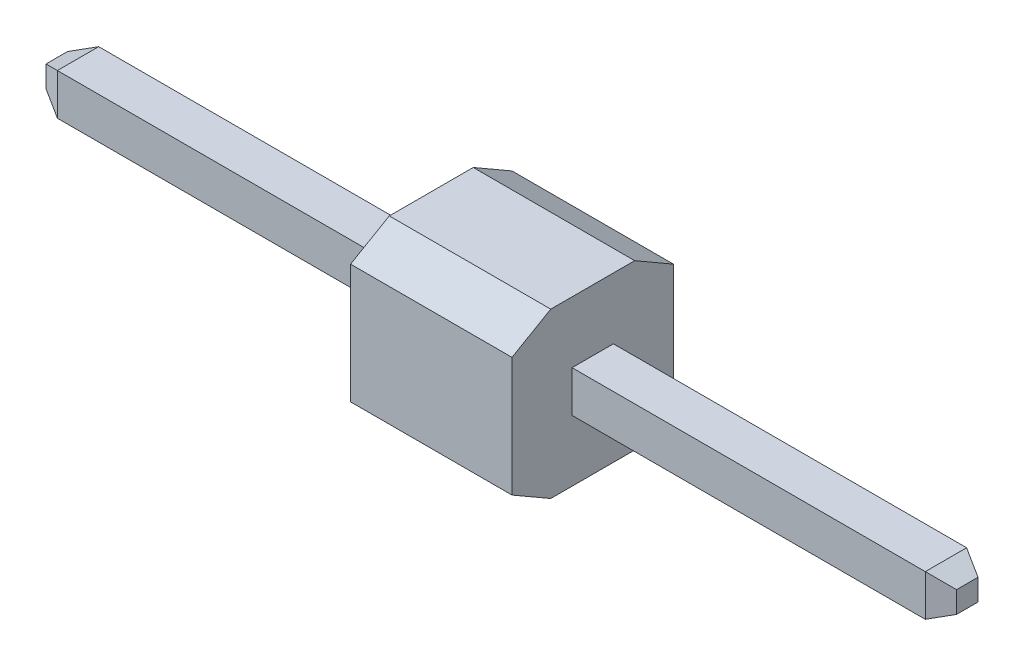
ISO-10303-21;
HEADER;
FILE_DESCRIPTION(('STEP AP214'),'2;1');
FILE_NAME('part.step','',(''),(''),'','','');
FILE_SCHEMA(('AUTOMOTIVE_DESIGN { 1 0 10303 214 1 1 1 1 }'));
ENDSEC;
DATA;
#1=APPLICATION_CONTEXT('core data for automotive mechanical design processes');
#2=APPLICATION_PROTOCOL_DEFINITION('international standard','automotive_design',2000,#1);
#3=PRODUCT_CONTEXT('',#1,'mechanical');
#4=PRODUCT('Part','Part','',(#3));
#5=PRODUCT_RELATED_PRODUCT_CATEGORY('part','',(#4));
#6=PRODUCT_DEFINITION_FORMATION('','',#4);
#7=PRODUCT_DEFINITION_CONTEXT('part definition',#1,'design');
#8=PRODUCT_DEFINITION('design','',#6,#7);
#9=PRODUCT_DEFINITION_SHAPE('','',#8);
#10=(LENGTH_UNIT() NAMED_UNIT(*) SI_UNIT(.MILLI.,.METRE.));
#11=(NAMED_UNIT(*) PLANE_ANGLE_UNIT() SI_UNIT($,.RADIAN.));
#12=(NAMED_UNIT(*) SI_UNIT($,.STERADIAN.) SOLID_ANGLE_UNIT());
#13=UNCERTAINTY_MEASURE_WITH_UNIT(LENGTH_MEASURE(1.E-05),#10,'distance_accuracy_value','');
#14=(GEOMETRIC_REPRESENTATION_CONTEXT(3) GLOBAL_UNCERTAINTY_ASSIGNED_CONTEXT((#13)) GLOBAL_UNIT_ASSIGNED_CONTEXT((#10,
#11,#12)) REPRESENTATION_CONTEXT('',''));
#15=CARTESIAN_POINT('',(0.,0.,0.));
#16=DIRECTION('',(0.,0.,1.));
#17=DIRECTION('',(1.,0.,0.));
#18=AXIS2_PLACEMENT_3D('',#15,#16,#17);
#19=CARTESIAN_POINT('',(5.42107461246523,7.3028784128063,0.629998634255617));
#20=DIRECTION('',(1.,4.37113882867379E-08,-4.37113882867379E-08));
#21=DIRECTION('',(-4.37113882867379E-08,1.,0.));
#22=AXIS2_PLACEMENT_3D('',#19,#20,#21);
#23=PLANE('',#22);
#24=DIRECTION('',(1.59994790123753E-08,0.50000000000019,0.866025403784329));
#25=VECTOR('',#24,1.);
#26=CARTESIAN_POINT('',(5.42107448947931,8.5464682512923,-0.940001365744382));
#27=LINE('',#26,#25);
#28=CARTESIAN_POINT('',(5.42107448947931,8.5464682512923,-0.940001365744382));
#29=VERTEX_POINT('',#28);
#30=CARTESIAN_POINT('',(5.42107450056408,8.8928784128063,-0.340001365744383));
#31=VERTEX_POINT('',#30);
#32=EDGE_CURVE('E11',#29,#31,#27,.T.);
#33=ORIENTED_EDGE('',*,*,#32,.T.);
#34=DIRECTION('',(4.37113886966664E-08,0.,0.999999999999999));
#35=VECTOR('',#34,1.);
#36=CARTESIAN_POINT('',(5.42107450056408,8.8928784128063,-0.340001365744383));
#37=LINE('',#36,#35);
#38=CARTESIAN_POINT('',(5.42107455738888,8.8928784128063,0.959998634255618));
#39=VERTEX_POINT('',#38);
#40=EDGE_CURVE('E304',#31,#39,#37,.T.);
#41=ORIENTED_EDGE('',*,*,#40,.T.);
#42=DIRECTION('',(5.97108656004285E-08,-0.500000000000188,0.866025403784328));
#43=VECTOR('',#42,1.);
#44=CARTESIAN_POINT('',(5.42107455738888,8.8928784128063,0.959998634255618));
#45=LINE('',#44,#43);
#46=CARTESIAN_POINT('',(5.42107459875778,8.5464682512923,1.55999863425562));
#47=VERTEX_POINT('',#46);
#48=EDGE_CURVE('E296',#39,#47,#45,.T.);
#49=ORIENTED_EDGE('',*,*,#48,.T.);
#50=DIRECTION('',(4.37113884815072E-08,-0.999999999999999,0.));
#51=VECTOR('',#50,1.);
#52=CARTESIAN_POINT('',(5.42107459875778,8.5464682512923,1.55999863425562));
#53=LINE('',#52,#51);
#54=CARTESIAN_POINT('',(5.42107467950057,6.6992885743203,1.55999863425562));
#55=VERTEX_POINT('',#54);
#56=EDGE_CURVE('E281',#47,#55,#53,.T.);
#57=ORIENTED_EDGE('',*,*,#56,.T.);
#58=DIRECTION('',(1.59994777304001E-08,0.500000000000191,0.866025403784328));
#59=VECTOR('',#58,1.);
#60=CARTESIAN_POINT('',(5.42107466841581,6.3528784128063,0.959998634255618));
#61=LINE('',#60,#59);
#62=CARTESIAN_POINT('',(5.42107466841581,6.3528784128063,0.959998634255618));
#63=VERTEX_POINT('',#62);
#64=EDGE_CURVE('E265',#63,#55,#61,.T.);
#65=ORIENTED_EDGE('',*,*,#64,.F.);
#66=DIRECTION('',(4.37113886966664E-08,0.,0.999999999999999));
#67=VECTOR('',#66,1.);
#68=CARTESIAN_POINT('',(5.421074611591,6.3528784128063,-0.340001365744383));
#69=LINE('',#68,#67);
#70=CARTESIAN_POINT('',(5.421074611591,6.3528784128063,-0.340001365744383));
#71=VERTEX_POINT('',#70);
#72=EDGE_CURVE('E248',#71,#63,#69,.T.);
#73=ORIENTED_EDGE('',*,*,#72,.F.);
#74=DIRECTION('',(5.97108668824036E-08,-0.500000000000189,0.866025403784328));
#75=VECTOR('',#74,1.);
#76=CARTESIAN_POINT('',(5.4210745702221,6.6992885743203,-0.940001365744382));
#77=LINE('',#76,#75);
#78=CARTESIAN_POINT('',(5.4210745702221,6.6992885743203,-0.940001365744382));
#79=VERTEX_POINT('',#78);
#80=EDGE_CURVE('E242',#79,#71,#77,.T.);
#81=ORIENTED_EDGE('',*,*,#80,.F.);
#82=DIRECTION('',(4.37113884815072E-08,-0.999999999999999,0.));
#83=VECTOR('',#82,1.);
#84=CARTESIAN_POINT('',(5.42107448947931,8.5464682512923,-0.940001365744382));
#85=LINE('',#84,#83);
#86=EDGE_CURVE('E236',#29,#79,#85,.T.);
#87=ORIENTED_EDGE('',*,*,#86,.F.);
#88=EDGE_LOOP('',(#33,#41,#49,#57,#65,#73,#81,#87));
#89=FACE_BOUND('',#88,.T.);
#90=DIRECTION('',(-4.37113886753159E-08,0.,-0.999999999999999));
#91=VECTOR('',#90,1.);
#92=CARTESIAN_POINT('',(5.42107458448994,7.9428784128063,0.629998634255617));
#93=LINE('',#92,#91);
#94=CARTESIAN_POINT('',(5.42107458448994,7.9428784128063,0.629998634255617));
#95=VERTEX_POINT('',#94);
#96=CARTESIAN_POINT('',(5.42107455651465,7.9428784128063,-0.0100013657443826));
#97=VERTEX_POINT('',#96);
#98=EDGE_CURVE('E302',#95,#97,#93,.T.);
#99=ORIENTED_EDGE('',*,*,#98,.T.);
#100=DIRECTION('',(-4.3711388675316E-08,0.999999999999999,0.));
#101=VECTOR('',#100,1.);
#102=CARTESIAN_POINT('',(5.42107458448994,7.3028784128063,-0.0100013657443826));
#103=LINE('',#102,#101);
#104=CARTESIAN_POINT('',(5.42107458448994,7.3028784128063,-0.0100013657443826));
#105=VERTEX_POINT('',#104);
#106=EDGE_CURVE('E293',#105,#97,#103,.T.);
#107=ORIENTED_EDGE('',*,*,#106,.F.);
#108=DIRECTION('',(-4.37113886753159E-08,0.,-0.999999999999999));
#109=VECTOR('',#108,1.);
#110=CARTESIAN_POINT('',(5.42107461246523,7.3028784128063,0.629998634255617));
#111=LINE('',#110,#109);
#112=CARTESIAN_POINT('',(5.42107461246523,7.3028784128063,0.629998634255617));
#113=VERTEX_POINT('',#112);
#114=EDGE_CURVE('E278',#113,#105,#111,.T.);
#115=ORIENTED_EDGE('',*,*,#114,.F.);
#116=DIRECTION('',(-4.3711388675316E-08,0.999999999999999,0.));
#117=VECTOR('',#116,1.);
#118=CARTESIAN_POINT('',(5.42107461246523,7.3028784128063,0.629998634255617));
#119=LINE('',#118,#117);
#120=EDGE_CURVE('E263',#113,#95,#119,.T.);
#121=ORIENTED_EDGE('',*,*,#120,.T.);
#122=EDGE_LOOP('',(#99,#107,#115,#121));
#123=FACE_BOUND('',#122,.T.);
#124=ADVANCED_FACE('F17',(#89,#123),#23,.T.);
#125=CARTESIAN_POINT('',(2.92107461246523,7.30287830352783,0.629998743534088));
#126=DIRECTION('',(1.,4.37113882867379E-08,-4.37113882867379E-08));
#127=DIRECTION('',(-4.37113882867379E-08,1.,0.));
#128=AXIS2_PLACEMENT_3D('',#125,#126,#127);
#129=PLANE('',#128);
#130=DIRECTION('',(1.59994783713877E-08,0.50000000000019,0.866025403784329));
#131=VECTOR('',#130,1.);
#132=CARTESIAN_POINT('',(2.92107448947931,8.54646814201383,-0.940001256465912));
#133=LINE('',#132,#131);
#134=CARTESIAN_POINT('',(2.92107448947931,8.54646814201383,-0.940001256465912));
#135=VERTEX_POINT('',#134);
#136=CARTESIAN_POINT('',(2.92107450056408,8.89287830352783,-0.340001256465912));
#137=VERTEX_POINT('',#136);
#138=EDGE_CURVE('E24',#135,#137,#133,.T.);
#139=ORIENTED_EDGE('',*,*,#138,.F.);
#140=DIRECTION('',(4.37113882410924E-08,-0.999999999999999,0.));
#141=VECTOR('',#140,1.);
#142=CARTESIAN_POINT('',(2.92107448947931,8.54646814201383,-0.940001256465912));
#143=LINE('',#142,#141);
#144=CARTESIAN_POINT('',(2.9210745702221,6.69928846504183,-0.940001256465912));
#145=VERTEX_POINT('',#144);
#146=EDGE_CURVE('E300',#135,#145,#143,.T.);
#147=ORIENTED_EDGE('',*,*,#146,.T.);
#148=DIRECTION('',(5.97108668824036E-08,-0.500000000000189,0.866025403784328));
#149=VECTOR('',#148,1.);
#150=CARTESIAN_POINT('',(2.9210745702221,6.69928846504183,-0.940001256465912));
#151=LINE('',#150,#149);
#152=CARTESIAN_POINT('',(2.921074611591,6.35287830352783,-0.340001256465912));
#153=VERTEX_POINT('',#152);
#154=EDGE_CURVE('E286',#145,#153,#151,.T.);
#155=ORIENTED_EDGE('',*,*,#154,.T.);
#156=DIRECTION('',(4.37113883550593E-08,0.,0.999999999999999));
#157=VECTOR('',#156,1.);
#158=CARTESIAN_POINT('',(2.921074611591,6.35287830352783,-0.340001256465912));
#159=LINE('',#158,#157);
#160=CARTESIAN_POINT('',(2.92107466841581,6.35287830352783,0.959998743534088));
#161=VERTEX_POINT('',#160);
#162=EDGE_CURVE('E271',#153,#161,#159,.T.);
#163=ORIENTED_EDGE('',*,*,#162,.T.);
#164=DIRECTION('',(1.59994783713877E-08,0.500000000000191,0.866025403784328));
#165=VECTOR('',#164,1.);
#166=CARTESIAN_POINT('',(2.92107466841581,6.35287830352783,0.959998743534088));
#167=LINE('',#166,#165);
#168=CARTESIAN_POINT('',(2.92107467950057,6.69928846504183,1.55999874353409));
#169=VERTEX_POINT('',#168);
#170=EDGE_CURVE('E253',#161,#169,#167,.T.);
#171=ORIENTED_EDGE('',*,*,#170,.T.);
#172=DIRECTION('',(4.37113882410924E-08,-0.999999999999999,0.));
#173=VECTOR('',#172,1.);
#174=CARTESIAN_POINT('',(2.92107459875778,8.54646814201383,1.55999874353409));
#175=LINE('',#174,#173);
#176=CARTESIAN_POINT('',(2.92107459875778,8.54646814201383,1.55999874353409));
#177=VERTEX_POINT('',#176);
#178=EDGE_CURVE('E261',#177,#169,#175,.T.);
#179=ORIENTED_EDGE('',*,*,#178,.F.);
#180=DIRECTION('',(5.97108668824036E-08,-0.500000000000188,0.866025403784328));
#181=VECTOR('',#180,1.);
#182=CARTESIAN_POINT('',(2.92107455738888,8.89287830352783,0.959998743534088));
#183=LINE('',#182,#181);
#184=CARTESIAN_POINT('',(2.92107455738888,8.89287830352783,0.959998743534088));
#185=VERTEX_POINT('',#184);
#186=EDGE_CURVE('E276',#185,#177,#183,.T.);
#187=ORIENTED_EDGE('',*,*,#186,.F.);
#188=DIRECTION('',(4.37113883550593E-08,0.,0.999999999999999));
#189=VECTOR('',#188,1.);
#190=CARTESIAN_POINT('',(2.92107450056408,8.89287830352783,-0.340001256465912));
#191=LINE('',#190,#189);
#192=EDGE_CURVE('E291',#137,#185,#191,.T.);
#193=ORIENTED_EDGE('',*,*,#192,.F.);
#194=EDGE_LOOP('',(#139,#147,#155,#163,#171,#179,#187,#193));
#195=FACE_BOUND('',#194,.T.);
#196=DIRECTION('',(-4.37113879814266E-08,0.999999999999999,0.));
#197=VECTOR('',#196,1.);
#198=CARTESIAN_POINT('',(2.92107458448994,7.30287830352783,-0.0100012564659119));
#199=LINE('',#198,#197);
#200=CARTESIAN_POINT('',(2.92107458448994,7.30287830352783,-0.0100012564659119));
#201=VERTEX_POINT('',#200);
#202=CARTESIAN_POINT('',(2.92107455651465,7.94287830352783,-0.0100012564659119));
#203=VERTEX_POINT('',#202);
#204=EDGE_CURVE('E298',#201,#203,#199,.T.);
#205=ORIENTED_EDGE('',*,*,#204,.T.);
#206=DIRECTION('',(-4.37113879814266E-08,0.,-0.999999999999999));
#207=VECTOR('',#206,1.);
#208=CARTESIAN_POINT('',(2.92107458448994,7.94287830352783,0.629998743534088));
#209=LINE('',#208,#207);
#210=CARTESIAN_POINT('',(2.92107458448994,7.94287830352783,0.629998743534088));
#211=VERTEX_POINT('',#210);
#212=EDGE_CURVE('E283',#211,#203,#209,.T.);
#213=ORIENTED_EDGE('',*,*,#212,.F.);
#214=DIRECTION('',(-4.3711388675316E-08,0.999999999999999,0.));
#215=VECTOR('',#214,1.);
#216=CARTESIAN_POINT('',(2.92107461246523,7.30287830352783,0.629998743534088));
#217=LINE('',#216,#215);
#218=CARTESIAN_POINT('',(2.92107461246523,7.30287830352783,0.629998743534088));
#219=VERTEX_POINT('',#218);
#220=EDGE_CURVE('E268',#219,#211,#217,.T.);
#221=ORIENTED_EDGE('',*,*,#220,.F.);
#222=DIRECTION('',(-4.37113886753159E-08,0.,-0.999999999999999));
#223=VECTOR('',#222,1.);
#224=CARTESIAN_POINT('',(2.92107461246523,7.30287830352783,0.629998743534088));
#225=LINE('',#224,#223);
#226=EDGE_CURVE('E251',#219,#201,#225,.T.);
#227=ORIENTED_EDGE('',*,*,#226,.T.);
#228=EDGE_LOOP('',(#205,#213,#221,#227));
#229=FACE_BOUND('',#228,.T.);
#230=ADVANCED_FACE('F314',(#195,#229),#129,.F.);
#231=CARTESIAN_POINT('',(5.42107448947931,8.5464682512923,-0.940001365744382));
#232=DIRECTION('',(5.97108668343731E-08,-0.866025403784328,0.50000000000019));
#233=DIRECTION('',(-1.59994785476185E-08,-0.500000000000192,-0.866025403784329));
#234=AXIS2_PLACEMENT_3D('',#231,#232,#233);
#235=PLANE('',#234);
#236=ORIENTED_EDGE('',*,*,#138,.T.);
#237=DIRECTION('',(-0.999999999999998,-4.37113882867378E-08,4.37113883755557E-08));
#238=VECTOR('',#237,1.);
#239=CARTESIAN_POINT('',(5.42107450056408,8.8928784128063,-0.340001365744383));
#240=LINE('',#239,#238);
#241=EDGE_CURVE('E288',#31,#137,#240,.T.);
#242=ORIENTED_EDGE('',*,*,#241,.F.);
#243=ORIENTED_EDGE('',*,*,#32,.F.);
#244=DIRECTION('',(-0.999999999999998,-4.37113882867378E-08,4.37113881091022E-08));
#245=VECTOR('',#244,1.);
#246=CARTESIAN_POINT('',(5.42107448947931,8.5464682512923,-0.940001365744382));
#247=LINE('',#246,#245);
#248=EDGE_CURVE('E256',#29,#135,#247,.T.);
#249=ORIENTED_EDGE('',*,*,#248,.T.);
#250=EDGE_LOOP('',(#236,#242,#243,#249));
#251=FACE_BOUND('',#250,.T.);
#252=ADVANCED_FACE('F306',(#251),#235,.F.);
#253=CARTESIAN_POINT('',(5.42107450056408,8.8928784128063,-0.340001365744383));
#254=DIRECTION('',(4.37113882867379E-08,-1.,0.));
#255=DIRECTION('',(1.,4.37113882867379E-08,-4.37113882867379E-08));
#256=AXIS2_PLACEMENT_3D('',#253,#254,#255);
#257=PLANE('',#256);
#258=ORIENTED_EDGE('',*,*,#192,.T.);
#259=DIRECTION('',(-0.999999999999998,-4.37113882867378E-08,4.37113882867378E-08));
#260=VECTOR('',#259,1.);
#261=CARTESIAN_POINT('',(5.42107455738888,8.8928784128063,0.959998634255618));
#262=LINE('',#261,#260);
#263=EDGE_CURVE('E273',#39,#185,#262,.T.);
#264=ORIENTED_EDGE('',*,*,#263,.F.);
#265=ORIENTED_EDGE('',*,*,#40,.F.);
#266=ORIENTED_EDGE('',*,*,#241,.T.);
#267=EDGE_LOOP('',(#258,#264,#265,#266));
#268=FACE_BOUND('',#267,.T.);
#269=ADVANCED_FACE('F311',(#268),#257,.F.);
#270=CARTESIAN_POINT('',(5.42107455738888,8.8928784128063,0.959998634255618));
#271=DIRECTION('',(1.59994785476185E-08,-0.86602540378433,-0.50000000000019));
#272=DIRECTION('',(-5.97108668343731E-08,0.500000000000188,-0.866025403784329));
#273=AXIS2_PLACEMENT_3D('',#270,#271,#272);
#274=PLANE('',#273);
#275=ORIENTED_EDGE('',*,*,#186,.T.);
#276=DIRECTION('',(-0.999999999999998,-4.37113875761951E-08,4.37113882867378E-08));
#277=VECTOR('',#276,1.);
#278=CARTESIAN_POINT('',(5.42107459875778,8.5464682512923,1.55999863425562));
#279=LINE('',#278,#277);
#280=EDGE_CURVE('E258',#47,#177,#279,.T.);
#281=ORIENTED_EDGE('',*,*,#280,.F.);
#282=ORIENTED_EDGE('',*,*,#48,.F.);
#283=ORIENTED_EDGE('',*,*,#263,.T.);
#284=EDGE_LOOP('',(#275,#281,#282,#283));
#285=FACE_BOUND('',#284,.T.);
#286=ADVANCED_FACE('F319',(#285),#274,.F.);
#287=CARTESIAN_POINT('',(5.42107459875778,8.5464682512923,1.55999863425562));
#288=DIRECTION('',(-4.37113882867379E-08,0.,-1.));
#289=DIRECTION('',(-1.,-4.37113882867379E-08,4.37113882867379E-08));
#290=AXIS2_PLACEMENT_3D('',#287,#288,#289);
#291=PLANE('',#290);
#292=ORIENTED_EDGE('',*,*,#178,.T.);
#293=DIRECTION('',(-0.999999999999998,-4.37113882867378E-08,4.37113882867378E-08));
#294=VECTOR('',#293,1.);
#295=CARTESIAN_POINT('',(5.42107467950057,6.6992885743203,1.55999863425562));
#296=LINE('',#295,#294);
#297=EDGE_CURVE('E245',#55,#169,#296,.T.);
#298=ORIENTED_EDGE('',*,*,#297,.F.);
#299=ORIENTED_EDGE('',*,*,#56,.F.);
#300=ORIENTED_EDGE('',*,*,#280,.T.);
#301=EDGE_LOOP('',(#292,#298,#299,#300));
#302=FACE_BOUND('',#301,.T.);
#303=ADVANCED_FACE('F326',(#302),#291,.F.);
#304=CARTESIAN_POINT('',(5.42107466841581,6.3528784128063,0.959998634255618));
#305=DIRECTION('',(5.97108668343731E-08,-0.866025403784328,0.50000000000019));
#306=DIRECTION('',(-1.59994785476185E-08,-0.500000000000192,-0.866025403784329));
#307=AXIS2_PLACEMENT_3D('',#304,#305,#306);
#308=PLANE('',#307);
#309=ORIENTED_EDGE('',*,*,#170,.F.);
#310=DIRECTION('',(-0.999999999999998,-4.37113886420092E-08,4.37113882867378E-08));
#311=VECTOR('',#310,1.);
#312=CARTESIAN_POINT('',(5.42107466841581,6.3528784128063,0.959998634255618));
#313=LINE('',#312,#311);
#314=EDGE_CURVE('E239',#63,#161,#313,.T.);
#315=ORIENTED_EDGE('',*,*,#314,.F.);
#316=ORIENTED_EDGE('',*,*,#64,.T.);
#317=ORIENTED_EDGE('',*,*,#297,.T.);
#318=EDGE_LOOP('',(#309,#315,#316,#317));
#319=FACE_BOUND('',#318,.T.);
#320=ADVANCED_FACE('F329',(#319),#308,.T.);
#321=CARTESIAN_POINT('',(5.421074611591,6.3528784128063,-0.340001365744383));
#322=DIRECTION('',(4.37113882867379E-08,-1.,0.));
#323=DIRECTION('',(1.,4.37113882867379E-08,-4.37113882867379E-08));
#324=AXIS2_PLACEMENT_3D('',#321,#322,#323);
#325=PLANE('',#324);
#326=ORIENTED_EDGE('',*,*,#162,.F.);
#327=DIRECTION('',(-0.999999999999998,-4.37113886420092E-08,4.37113883755557E-08));
#328=VECTOR('',#327,1.);
#329=CARTESIAN_POINT('',(5.421074611591,6.3528784128063,-0.340001365744383));
#330=LINE('',#329,#328);
#331=EDGE_CURVE('E233',#71,#153,#330,.T.);
#332=ORIENTED_EDGE('',*,*,#331,.F.);
#333=ORIENTED_EDGE('',*,*,#72,.T.);
#334=ORIENTED_EDGE('',*,*,#314,.T.);
#335=EDGE_LOOP('',(#326,#332,#333,#334));
#336=FACE_BOUND('',#335,.T.);
#337=ADVANCED_FACE('F333',(#336),#325,.T.);
#338=CARTESIAN_POINT('',(5.4210745702221,6.6992885743203,-0.940001365744382));
#339=DIRECTION('',(1.59994785476185E-08,-0.86602540378433,-0.50000000000019));
#340=DIRECTION('',(-5.97108668343731E-08,0.500000000000188,-0.866025403784329));
#341=AXIS2_PLACEMENT_3D('',#338,#339,#340);
#342=PLANE('',#341);
#343=ORIENTED_EDGE('',*,*,#154,.F.);
#344=DIRECTION('',(-0.999999999999998,-4.37113882867378E-08,4.37113881091022E-08));
#345=VECTOR('',#344,1.);
#346=CARTESIAN_POINT('',(5.4210745702221,6.6992885743203,-0.940001365744382));
#347=LINE('',#346,#345);
#348=EDGE_CURVE('E230',#79,#145,#347,.T.);
#349=ORIENTED_EDGE('',*,*,#348,.F.);
#350=ORIENTED_EDGE('',*,*,#80,.T.);
#351=ORIENTED_EDGE('',*,*,#331,.T.);
#352=EDGE_LOOP('',(#343,#349,#350,#351));
#353=FACE_BOUND('',#352,.T.);
#354=ADVANCED_FACE('F337',(#353),#342,.T.);
#355=CARTESIAN_POINT('',(5.42107448947931,8.5464682512923,-0.940001365744382));
#356=DIRECTION('',(-4.37113882867379E-08,0.,-1.));
#357=DIRECTION('',(-4.37113882867379E-08,1.,0.));
#358=AXIS2_PLACEMENT_3D('',#355,#356,#357);
#359=PLANE('',#358);
#360=ORIENTED_EDGE('',*,*,#146,.F.);
#361=ORIENTED_EDGE('',*,*,#248,.F.);
#362=ORIENTED_EDGE('',*,*,#86,.T.);
#363=ORIENTED_EDGE('',*,*,#348,.T.);
#364=EDGE_LOOP('',(#360,#361,#362,#363));
#365=FACE_BOUND('',#364,.T.);
#366=ADVANCED_FACE('F339',(#365),#359,.T.);
#367=CARTESIAN_POINT('',(-2.87892538753477,7.30287805000178,0.62999899706014));
#368=DIRECTION('',(-1.,-4.37113882867379E-08,4.37113882867379E-08));
#369=DIRECTION('',(4.37113882867379E-08,-1.,0.));
#370=AXIS2_PLACEMENT_3D('',#367,#368,#369);
#371=PLANE('',#370);
#372=DIRECTION('',(4.37113847280434E-08,-0.999999999999999,0.));
#373=VECTOR('',#372,1.);
#374=CARTESIAN_POINT('',(-2.8789254300326,7.78899652281078,0.14388052425114));
#375=LINE('',#374,#373);
#376=CARTESIAN_POINT('',(-2.8789254300326,7.78899652281078,0.14388052425114));
#377=VERTEX_POINT('',#376);
#378=CARTESIAN_POINT('',(-2.87892541551006,7.45675957719278,0.14388052425114));
#379=VERTEX_POINT('',#378);
#380=EDGE_CURVE('E228',#377,#379,#375,.T.);
#381=ORIENTED_EDGE('',*,*,#380,.T.);
#382=DIRECTION('',(4.37113874013716E-08,0.,0.999999999999999));
#383=VECTOR('',#382,1.);
#384=CARTESIAN_POINT('',(-2.87892541551006,7.45675957719278,0.14388052425114));
#385=LINE('',#384,#383);
#386=CARTESIAN_POINT('',(-2.87892540098752,7.45675957719278,0.47611746986914));
#387=VERTEX_POINT('',#386);
#388=EDGE_CURVE('E223',#379,#387,#385,.T.);
#389=ORIENTED_EDGE('',*,*,#388,.T.);
#390=DIRECTION('',(-4.37113900746999E-08,0.999999999999999,0.));
#391=VECTOR('',#390,1.);
#392=CARTESIAN_POINT('',(-2.87892540098752,7.45675957719278,0.47611746986914));
#393=LINE('',#392,#391);
#394=CARTESIAN_POINT('',(-2.87892541551006,7.78899652281078,0.47611746986914));
#395=VERTEX_POINT('',#394);
#396=EDGE_CURVE('E215',#387,#395,#393,.T.);
#397=ORIENTED_EDGE('',*,*,#396,.T.);
#398=DIRECTION('',(-4.37113820547151E-08,0.,-0.999999999999999));
#399=VECTOR('',#398,1.);
#400=CARTESIAN_POINT('',(-2.87892541551006,7.78899652281078,0.47611746986914));
#401=LINE('',#400,#399);
#402=EDGE_CURVE('E207',#395,#377,#401,.T.);
#403=ORIENTED_EDGE('',*,*,#402,.T.);
#404=EDGE_LOOP('',(#381,#389,#397,#403));
#405=FACE_BOUND('',#404,.T.);
#406=ADVANCED_FACE('F341',(#405),#371,.T.);
#407=CARTESIAN_POINT('',(-2.87892538753477,7.30287805000178,0.62999899706014));
#408=DIRECTION('',(4.37113882867379E-08,-1.,0.));
#409=DIRECTION('',(-4.37113882867379E-08,0.,-1.));
#410=AXIS2_PLACEMENT_3D('',#407,#408,#409);
#411=PLANE('',#410);
#412=DIRECTION('',(0.999999999999998,4.37113886829271E-08,-4.37113882769955E-08));
#413=VECTOR('',#412,1.);
#414=CARTESIAN_POINT('',(-2.54892538753477,7.30287806442654,0.629998982635382));
#415=LINE('',#414,#413);
#416=CARTESIAN_POINT('',(-2.54892538753477,7.30287806442654,0.629998982635382));
#417=VERTEX_POINT('',#416);
#418=EDGE_CURVE('E225',#417,#219,#415,.T.);
#419=ORIENTED_EDGE('',*,*,#418,.F.);
#420=DIRECTION('',(-4.37113886753159E-08,0.,-0.999999999999999));
#421=VECTOR('',#420,1.);
#422=CARTESIAN_POINT('',(-2.54892538753477,7.30287806442654,0.629998982635382));
#423=LINE('',#422,#421);
#424=CARTESIAN_POINT('',(-2.54892541551006,7.30287806442654,-0.010001017364618));
#425=VERTEX_POINT('',#424);
#426=EDGE_CURVE('E217',#417,#425,#423,.T.);
#427=ORIENTED_EDGE('',*,*,#426,.T.);
#428=DIRECTION('',(0.999999999999998,4.37113886829271E-08,-4.37113882161057E-08));
#429=VECTOR('',#428,1.);
#430=CARTESIAN_POINT('',(-2.54892541551006,7.30287806442654,-0.010001017364618));
#431=LINE('',#430,#429);
#432=EDGE_CURVE('E220',#425,#201,#431,.T.);
#433=ORIENTED_EDGE('',*,*,#432,.T.);
#434=ORIENTED_EDGE('',*,*,#226,.F.);
#435=EDGE_LOOP('',(#419,#427,#433,#434));
#436=FACE_BOUND('',#435,.T.);
#437=ADVANCED_FACE('F348',(#436),#411,.T.);
#438=CARTESIAN_POINT('',(-2.87892541551006,7.30287805000178,-0.0100010029398598));
#439=DIRECTION('',(-4.37113882867379E-08,0.,-1.));
#440=DIRECTION('',(-1.,-4.37113882867379E-08,4.37113882867379E-08));
#441=AXIS2_PLACEMENT_3D('',#438,#439,#440);
#442=PLANE('',#441);
#443=ORIENTED_EDGE('',*,*,#432,.F.);
#444=DIRECTION('',(-4.3711388675316E-08,0.999999999999999,0.));
#445=VECTOR('',#444,1.);
#446=CARTESIAN_POINT('',(-2.54892541551006,7.30287806442654,-0.010001017364618));
#447=LINE('',#446,#445);
#448=CARTESIAN_POINT('',(-2.54892544348535,7.94287806442654,-0.010001017364618));
#449=VERTEX_POINT('',#448);
#450=EDGE_CURVE('E209',#425,#449,#447,.T.);
#451=ORIENTED_EDGE('',*,*,#450,.T.);
#452=DIRECTION('',(0.999999999999998,4.37113881958092E-08,-4.37113882161057E-08));
#453=VECTOR('',#452,1.);
#454=CARTESIAN_POINT('',(-2.54892544348535,7.94287806442654,-0.010001017364618));
#455=LINE('',#454,#453);
#456=EDGE_CURVE('E212',#449,#203,#455,.T.);
#457=ORIENTED_EDGE('',*,*,#456,.T.);
#458=ORIENTED_EDGE('',*,*,#204,.F.);
#459=EDGE_LOOP('',(#443,#451,#457,#458));
#460=FACE_BOUND('',#459,.T.);
#461=ADVANCED_FACE('F424',(#460),#442,.T.);
#462=CARTESIAN_POINT('',(-2.87892541551006,7.94287805000178,0.62999899706014));
#463=DIRECTION('',(4.37113882867379E-08,-1.,0.));
#464=DIRECTION('',(-4.37113882867379E-08,0.,-1.));
#465=AXIS2_PLACEMENT_3D('',#462,#463,#464);
#466=PLANE('',#465);
#467=ORIENTED_EDGE('',*,*,#456,.F.);
#468=DIRECTION('',(4.37113900630947E-08,0.,0.999999999999999));
#469=VECTOR('',#468,1.);
#470=CARTESIAN_POINT('',(-2.54892544348535,7.94287806442654,-0.010001017364618));
#471=LINE('',#470,#469);
#472=CARTESIAN_POINT('',(-2.54892541551006,7.94287806442654,0.629998982635382));
#473=VERTEX_POINT('',#472);
#474=EDGE_CURVE('E201',#449,#473,#471,.T.);
#475=ORIENTED_EDGE('',*,*,#474,.T.);
#476=DIRECTION('',(0.999999999999998,4.37113881958092E-08,-4.37113882769955E-08));
#477=VECTOR('',#476,1.);
#478=CARTESIAN_POINT('',(-2.54892541551006,7.94287806442654,0.629998982635382));
#479=LINE('',#478,#477);
#480=EDGE_CURVE('E204',#473,#211,#479,.T.);
#481=ORIENTED_EDGE('',*,*,#480,.T.);
#482=ORIENTED_EDGE('',*,*,#212,.T.);
#483=EDGE_LOOP('',(#467,#475,#481,#482));
#484=FACE_BOUND('',#483,.T.);
#485=ADVANCED_FACE('F421',(#484),#466,.F.);
#486=CARTESIAN_POINT('',(-2.87892538753477,7.30287805000178,0.62999899706014));
#487=DIRECTION('',(-4.37113882867379E-08,0.,-1.));
#488=DIRECTION('',(-1.,-4.37113882867379E-08,4.37113882867379E-08));
#489=AXIS2_PLACEMENT_3D('',#486,#487,#488);
#490=PLANE('',#489);
#491=ORIENTED_EDGE('',*,*,#480,.F.);
#492=DIRECTION('',(4.37113872875372E-08,-0.999999999999999,0.));
#493=VECTOR('',#492,1.);
#494=CARTESIAN_POINT('',(-2.54892541551006,7.94287806442654,0.629998982635382));
#495=LINE('',#494,#493);
#496=EDGE_CURVE('E196',#473,#417,#495,.T.);
#497=ORIENTED_EDGE('',*,*,#496,.T.);
#498=ORIENTED_EDGE('',*,*,#418,.T.);
#499=ORIENTED_EDGE('',*,*,#220,.T.);
#500=EDGE_LOOP('',(#491,#497,#498,#499));
#501=FACE_BOUND('',#500,.T.);
#502=ADVANCED_FACE('F376',(#501),#490,.F.);
#503=CARTESIAN_POINT('',(-2.87892538753477,7.30287805000178,0.62999899706014));
#504=DIRECTION('',(-4.37113882867379E-08,0.,-1.));
#505=DIRECTION('',(-1.,-4.37113882867379E-08,4.37113882867379E-08));
#506=AXIS2_PLACEMENT_3D('',#503,#504,#505);
#507=PLANE('',#506);
#508=DIRECTION('',(0.999999999999998,4.37113883581818E-08,-4.37113882769955E-08));
#509=VECTOR('',#508,1.);
#510=CARTESIAN_POINT('',(5.42107461246523,7.3028784128063,0.629998634255617));
#511=LINE('',#510,#509);
#512=CARTESIAN_POINT('',(10.8910746124652,7.3028786519076,0.629998395154324));
#513=VERTEX_POINT('',#512);
#514=EDGE_CURVE('E199',#113,#513,#511,.T.);
#515=ORIENTED_EDGE('',*,*,#514,.T.);
#516=DIRECTION('',(-4.37113900630947E-08,0.999999999999999,0.));
#517=VECTOR('',#516,1.);
#518=CARTESIAN_POINT('',(10.8910746124652,7.3028786519076,0.629998395154324));
#519=LINE('',#518,#517);
#520=CARTESIAN_POINT('',(10.8910745844899,7.9428786519076,0.629998395154324));
#521=VERTEX_POINT('',#520);
#522=EDGE_CURVE('E191',#513,#521,#519,.T.);
#523=ORIENTED_EDGE('',*,*,#522,.T.);
#524=DIRECTION('',(0.999999999999998,4.37113883581818E-08,-4.37113882769955E-08));
#525=VECTOR('',#524,1.);
#526=CARTESIAN_POINT('',(5.42107458448994,7.94287841280631,0.629998634255617));
#527=LINE('',#526,#525);
#528=EDGE_CURVE('E194',#95,#521,#527,.T.);
#529=ORIENTED_EDGE('',*,*,#528,.F.);
#530=ORIENTED_EDGE('',*,*,#120,.F.);
#531=EDGE_LOOP('',(#515,#523,#529,#530));
#532=FACE_BOUND('',#531,.T.);
#533=ADVANCED_FACE('F367',(#532),#507,.F.);
#534=CARTESIAN_POINT('',(-2.87892541551006,7.94287805000178,0.62999899706014));
#535=DIRECTION('',(4.37113882867379E-08,-1.,0.));
#536=DIRECTION('',(-4.37113882867379E-08,0.,-1.));
#537=AXIS2_PLACEMENT_3D('',#534,#535,#536);
#538=PLANE('',#537);
#539=ORIENTED_EDGE('',*,*,#528,.T.);
#540=DIRECTION('',(-4.37113900630947E-08,0.,-0.999999999999999));
#541=VECTOR('',#540,1.);
#542=CARTESIAN_POINT('',(10.8910745844899,7.9428786519076,0.629998395154324));
#543=LINE('',#542,#541);
#544=CARTESIAN_POINT('',(10.8910745565147,7.9428786519076,-0.0100016048456765));
#545=VERTEX_POINT('',#544);
#546=EDGE_CURVE('E186',#521,#545,#543,.T.);
#547=ORIENTED_EDGE('',*,*,#546,.T.);
#548=DIRECTION('',(0.999999999999998,4.37113883581818E-08,-4.37113881146228E-08));
#549=VECTOR('',#548,1.);
#550=CARTESIAN_POINT('',(5.42107455651465,7.9428784128063,-0.0100013657443823));
#551=LINE('',#550,#549);
#552=EDGE_CURVE('E189',#97,#545,#551,.T.);
#553=ORIENTED_EDGE('',*,*,#552,.F.);
#554=ORIENTED_EDGE('',*,*,#98,.F.);
#555=EDGE_LOOP('',(#539,#547,#553,#554));
#556=FACE_BOUND('',#555,.T.);
#557=ADVANCED_FACE('F364',(#556),#538,.F.);
#558=CARTESIAN_POINT('',(-2.87892541551006,7.30287805000178,-0.0100010029398598));
#559=DIRECTION('',(-4.37113882867379E-08,0.,-1.));
#560=DIRECTION('',(-1.,-4.37113882867379E-08,4.37113882867379E-08));
#561=AXIS2_PLACEMENT_3D('',#558,#559,#560);
#562=PLANE('',#561);
#563=ORIENTED_EDGE('',*,*,#552,.T.);
#564=DIRECTION('',(4.37113872875372E-08,-0.999999999999999,0.));
#565=VECTOR('',#564,1.);
#566=CARTESIAN_POINT('',(10.8910745565147,7.94287865190759,-0.0100016048456766));
#567=LINE('',#566,#565);
#568=CARTESIAN_POINT('',(10.8910745844899,7.3028786519076,-0.0100016048456765));
#569=VERTEX_POINT('',#568);
#570=EDGE_CURVE('E176',#545,#569,#567,.T.);
#571=ORIENTED_EDGE('',*,*,#570,.T.);
#572=DIRECTION('',(0.999999999999998,4.37113883581818E-08,-4.37113881146228E-08));
#573=VECTOR('',#572,1.);
#574=CARTESIAN_POINT('',(5.42107458448994,7.3028784128063,-0.0100013657443823));
#575=LINE('',#574,#573);
#576=EDGE_CURVE('E179',#105,#569,#575,.T.);
#577=ORIENTED_EDGE('',*,*,#576,.F.);
#578=ORIENTED_EDGE('',*,*,#106,.T.);
#579=EDGE_LOOP('',(#563,#571,#577,#578));
#580=FACE_BOUND('',#579,.T.);
#581=ADVANCED_FACE('F366',(#580),#562,.T.);
#582=CARTESIAN_POINT('',(-2.87892538753477,7.30287805000178,0.62999899706014));
#583=DIRECTION('',(4.37113882867379E-08,-1.,0.));
#584=DIRECTION('',(-4.37113882867379E-08,0.,-1.));
#585=AXIS2_PLACEMENT_3D('',#582,#583,#584);
#586=PLANE('',#585);
#587=ORIENTED_EDGE('',*,*,#576,.T.);
#588=DIRECTION('',(4.37113845119796E-08,0.,0.999999999999999));
#589=VECTOR('',#588,1.);
#590=CARTESIAN_POINT('',(10.8910745844899,7.3028786519076,-0.0100016048456765));
#591=LINE('',#590,#589);
#592=EDGE_CURVE('E167',#569,#513,#591,.T.);
#593=ORIENTED_EDGE('',*,*,#592,.T.);
#594=ORIENTED_EDGE('',*,*,#514,.F.);
#595=ORIENTED_EDGE('',*,*,#114,.T.);
#596=EDGE_LOOP('',(#587,#593,#594,#595));
#597=FACE_BOUND('',#596,.T.);
#598=ADVANCED_FACE('F373',(#597),#586,.T.);
#599=CARTESIAN_POINT('',(11.2210746124652,7.30287866633235,0.629998380729565));
#600=DIRECTION('',(-1.,-4.37113882867379E-08,4.37113882867379E-08));
#601=DIRECTION('',(4.37113882867379E-08,-1.,0.));
#602=AXIS2_PLACEMENT_3D('',#599,#600,#601);
#603=PLANE('',#602);
#604=DIRECTION('',(-4.37113927480282E-08,0.999999999999999,0.));
#605=VECTOR('',#604,1.);
#606=CARTESIAN_POINT('',(11.2210745844899,7.45676019352335,0.143879907920565));
#607=LINE('',#606,#605);
#608=CARTESIAN_POINT('',(11.2210745844899,7.45676019352335,0.143879907920565));
#609=VERTEX_POINT('',#608);
#610=CARTESIAN_POINT('',(11.2210745699674,7.78899713914135,0.143879907920565));
#611=VERTEX_POINT('',#610);
#612=EDGE_CURVE('E153',#609,#611,#607,.T.);
#613=ORIENTED_EDGE('',*,*,#612,.T.);
#614=DIRECTION('',(4.37113927480282E-08,0.,0.999999999999999));
#615=VECTOR('',#614,1.);
#616=CARTESIAN_POINT('',(11.2210745699674,7.78899713914135,0.143879907920565));
#617=LINE('',#616,#615);
#618=CARTESIAN_POINT('',(11.2210745844899,7.78899713914135,0.476116853538565));
#619=VERTEX_POINT('',#618);
#620=EDGE_CURVE('E395',#611,#619,#617,.T.);
#621=ORIENTED_EDGE('',*,*,#620,.T.);
#622=DIRECTION('',(4.37113874013716E-08,-0.999999999999999,0.));
#623=VECTOR('',#622,1.);
#624=CARTESIAN_POINT('',(11.2210745844899,7.78899713914135,0.476116853538565));
#625=LINE('',#624,#623);
#626=CARTESIAN_POINT('',(11.2210745990125,7.45676019352336,0.476116853538565));
#627=VERTEX_POINT('',#626);
#628=EDGE_CURVE('E156',#619,#627,#625,.T.);
#629=ORIENTED_EDGE('',*,*,#628,.T.);
#630=DIRECTION('',(-4.37113927480282E-08,0.,-0.999999999999999));
#631=VECTOR('',#630,1.);
#632=CARTESIAN_POINT('',(11.2210745990125,7.45676019352336,0.476116853538565));
#633=LINE('',#632,#631);
#634=EDGE_CURVE('E149',#627,#609,#633,.T.);
#635=ORIENTED_EDGE('',*,*,#634,.T.);
#636=EDGE_LOOP('',(#613,#621,#629,#635));
#637=FACE_BOUND('',#636,.T.);
#638=ADVANCED_FACE('F151',(#637),#603,.F.);
#639=CARTESIAN_POINT('',(-2.87892540878368,7.78899652281078,0.62999899706014));
#640=DIRECTION('',(-0.422618301356784,0.906307768563367,1.84732310895534E-08));
#641=DIRECTION('',(4.37113882867379E-08,0.,1.));
#642=AXIS2_PLACEMENT_3D('',#639,#640,#641);
#643=PLANE('',#642);
#644=DIRECTION('',(0.834817095446926,0.389281657126018,-0.389281657126018));
#645=VECTOR('',#644,1.);
#646=CARTESIAN_POINT('',(-2.87892543003229,7.78899652281045,0.143880524251471));
#647=LINE('',#646,#645);
#648=EDGE_CURVE('E181',#377,#449,#647,.T.);
#649=ORIENTED_EDGE('',*,*,#648,.F.);
#650=ORIENTED_EDGE('',*,*,#402,.F.);
#651=DIRECTION('',(-0.834817129479007,-0.389281657126017,-0.389281584143988));
#652=VECTOR('',#651,1.);
#653=CARTESIAN_POINT('',(-2.54892541550984,7.9428780644263,0.629998982635147));
#654=LINE('',#653,#652);
#655=EDGE_CURVE('E404',#473,#395,#654,.T.);
#656=ORIENTED_EDGE('',*,*,#655,.F.);
#657=ORIENTED_EDGE('',*,*,#474,.F.);
#658=EDGE_LOOP('',(#649,#650,#656,#657));
#659=FACE_BOUND('',#658,.T.);
#660=ADVANCED_FACE('F418',(#659),#643,.T.);
#661=CARTESIAN_POINT('',(-2.87892539426115,7.30287805000178,0.47611746986914));
#662=DIRECTION('',(-0.422618222124841,-1.84732292043498E-08,0.906307805509828));
#663=DIRECTION('',(4.37113882867379E-08,-1.,0.));
#664=AXIS2_PLACEMENT_3D('',#661,#662,#663);
#665=PLANE('',#664);
#666=ORIENTED_EDGE('',*,*,#655,.T.);
#667=ORIENTED_EDGE('',*,*,#396,.F.);
#668=DIRECTION('',(-0.834817163511087,0.389281584143987,-0.389281584143986));
#669=VECTOR('',#668,1.);
#670=CARTESIAN_POINT('',(-2.5489253875346,7.30287806442672,0.629998982635199));
#671=LINE('',#670,#669);
#672=EDGE_CURVE('E160',#417,#387,#671,.T.);
#673=ORIENTED_EDGE('',*,*,#672,.F.);
#674=ORIENTED_EDGE('',*,*,#496,.F.);
#675=EDGE_LOOP('',(#666,#667,#673,#674));
#676=FACE_BOUND('',#675,.T.);
#677=ADVANCED_FACE('F434',(#676),#665,.T.);
#678=CARTESIAN_POINT('',(-2.54892541551006,7.30287806442654,-0.010001017364618));
#679=DIRECTION('',(0.422618301356784,1.8473232667688E-08,0.906307768563367));
#680=DIRECTION('',(-4.37113882867379E-08,1.,0.));
#681=AXIS2_PLACEMENT_3D('',#678,#679,#680);
#682=PLANE('',#681);
#683=ORIENTED_EDGE('',*,*,#648,.T.);
#684=ORIENTED_EDGE('',*,*,#450,.F.);
#685=DIRECTION('',(0.834817129479007,-0.389281584143986,-0.389281657126019));
#686=VECTOR('',#685,1.);
#687=CARTESIAN_POINT('',(-2.87892541550997,7.45675957719287,0.143880524251236));
#688=LINE('',#687,#686);
#689=EDGE_CURVE('E170',#379,#425,#688,.T.);
#690=ORIENTED_EDGE('',*,*,#689,.F.);
#691=ORIENTED_EDGE('',*,*,#380,.F.);
#692=EDGE_LOOP('',(#683,#684,#690,#691));
#693=FACE_BOUND('',#692,.T.);
#694=ADVANCED_FACE('F413',(#693),#682,.F.);
#695=CARTESIAN_POINT('',(-2.54892538753477,7.30287806442654,0.629998982635382));
#696=DIRECTION('',(0.422618222124841,0.906307805509828,-1.84732308250282E-08));
#697=DIRECTION('',(-4.37113882867379E-08,0.,-1.));
#698=AXIS2_PLACEMENT_3D('',#695,#696,#697);
#699=PLANE('',#698);
#700=ORIENTED_EDGE('',*,*,#672,.T.);
#701=ORIENTED_EDGE('',*,*,#388,.F.);
#702=ORIENTED_EDGE('',*,*,#689,.T.);
#703=ORIENTED_EDGE('',*,*,#426,.F.);
#704=EDGE_LOOP('',(#700,#701,#702,#703));
#705=FACE_BOUND('',#704,.T.);
#706=ADVANCED_FACE('F429',(#705),#699,.F.);
#707=CARTESIAN_POINT('',(11.2210746057389,7.45676019352336,0.629998380729565));
#708=DIRECTION('',(0.422618301356784,-0.906307768563367,-1.84732310470096E-08));
#709=DIRECTION('',(4.37113882867379E-08,0.,1.));
#710=AXIS2_PLACEMENT_3D('',#707,#708,#709);
#711=PLANE('',#710);
#712=DIRECTION('',(-0.834817129479008,-0.389281657126016,-0.389281584143986));
#713=VECTOR('',#712,1.);
#714=CARTESIAN_POINT('',(11.2210745844896,7.45676019352368,0.143879907920897));
#715=LINE('',#714,#713);
#716=EDGE_CURVE('E164',#609,#569,#715,.T.);
#717=ORIENTED_EDGE('',*,*,#716,.F.);
#718=ORIENTED_EDGE('',*,*,#634,.F.);
#719=DIRECTION('',(0.834817095446928,0.389281657126016,-0.389281657126017));
#720=VECTOR('',#719,1.);
#721=CARTESIAN_POINT('',(10.8910746124652,7.3028786519076,0.629998395154324));
#722=LINE('',#721,#720);
#723=EDGE_CURVE('E392',#513,#627,#722,.T.);
#724=ORIENTED_EDGE('',*,*,#723,.F.);
#725=ORIENTED_EDGE('',*,*,#592,.F.);
#726=EDGE_LOOP('',(#717,#718,#724,#725));
#727=FACE_BOUND('',#726,.T.);
#728=ADVANCED_FACE('F165',(#727),#711,.T.);
#729=CARTESIAN_POINT('',(10.8910746124652,7.3028786519076,0.629998395154324));
#730=DIRECTION('',(-0.422618301356784,-1.8473232667688E-08,-0.906307768563367));
#731=DIRECTION('',(-4.37113882867379E-08,1.,0.));
#732=AXIS2_PLACEMENT_3D('',#729,#730,#731);
#733=PLANE('',#732);
#734=ORIENTED_EDGE('',*,*,#723,.T.);
#735=ORIENTED_EDGE('',*,*,#628,.F.);
#736=DIRECTION('',(0.834817129479007,-0.389281584143988,-0.389281657126017));
#737=VECTOR('',#736,1.);
#738=CARTESIAN_POINT('',(10.8910745844899,7.94287865190756,0.629998395154179));
#739=LINE('',#738,#737);
#740=EDGE_CURVE('E389',#521,#619,#739,.T.);
#741=ORIENTED_EDGE('',*,*,#740,.F.);
#742=ORIENTED_EDGE('',*,*,#522,.F.);
#743=EDGE_LOOP('',(#734,#735,#741,#742));
#744=FACE_BOUND('',#743,.T.);
#745=ADVANCED_FACE('F390',(#744),#733,.F.);
#746=CARTESIAN_POINT('',(11.2210745912163,7.30287866633235,0.143879907920565));
#747=DIRECTION('',(0.422618222124841,1.84732292043498E-08,-0.906307805509828));
#748=DIRECTION('',(4.37113882867379E-08,-1.,0.));
#749=AXIS2_PLACEMENT_3D('',#746,#747,#748);
#750=PLANE('',#749);
#751=ORIENTED_EDGE('',*,*,#716,.T.);
#752=ORIENTED_EDGE('',*,*,#570,.F.);
#753=DIRECTION('',(-0.834817163511085,0.38928158414399,-0.389281584143987));
#754=VECTOR('',#753,1.);
#755=CARTESIAN_POINT('',(11.2210745699671,7.78899713914102,0.143879907920896));
#756=LINE('',#755,#754);
#757=EDGE_CURVE('E175',#611,#545,#756,.T.);
#758=ORIENTED_EDGE('',*,*,#757,.F.);
#759=ORIENTED_EDGE('',*,*,#612,.F.);
#760=EDGE_LOOP('',(#751,#752,#758,#759));
#761=FACE_BOUND('',#760,.T.);
#762=ADVANCED_FACE('F173',(#761),#750,.T.);
#763=CARTESIAN_POINT('',(10.8910745844899,7.9428786519076,0.629998395154324));
#764=DIRECTION('',(-0.422618222124841,-0.906307805509828,1.84732307824844E-08));
#765=DIRECTION('',(-4.37113882867379E-08,0.,-1.));
#766=AXIS2_PLACEMENT_3D('',#763,#764,#765);
#767=PLANE('',#766);
#768=ORIENTED_EDGE('',*,*,#740,.T.);
#769=ORIENTED_EDGE('',*,*,#620,.F.);
#770=ORIENTED_EDGE('',*,*,#757,.T.);
#771=ORIENTED_EDGE('',*,*,#546,.F.);
#772=EDGE_LOOP('',(#768,#769,#770,#771));
#773=FACE_BOUND('',#772,.T.);
#774=ADVANCED_FACE('F394',(#773),#767,.F.);
#775=CLOSED_SHELL('',(#124,#230,#252,#269,#286,#303,#320,#337,#354,#366,#406,#437,#461,#485,
#502,#533,#557,#581,#598,#638,#660,#677,#694,#706,#728,#745,#762,#774));
#776=MANIFOLD_SOLID_BREP('B1',#775);
#777=ADVANCED_BREP_SHAPE_REPRESENTATION('',(#18,#776),#14);
#778=SHAPE_DEFINITION_REPRESENTATION(#9,#777);
ENDSEC;
END-ISO-10303-21;
